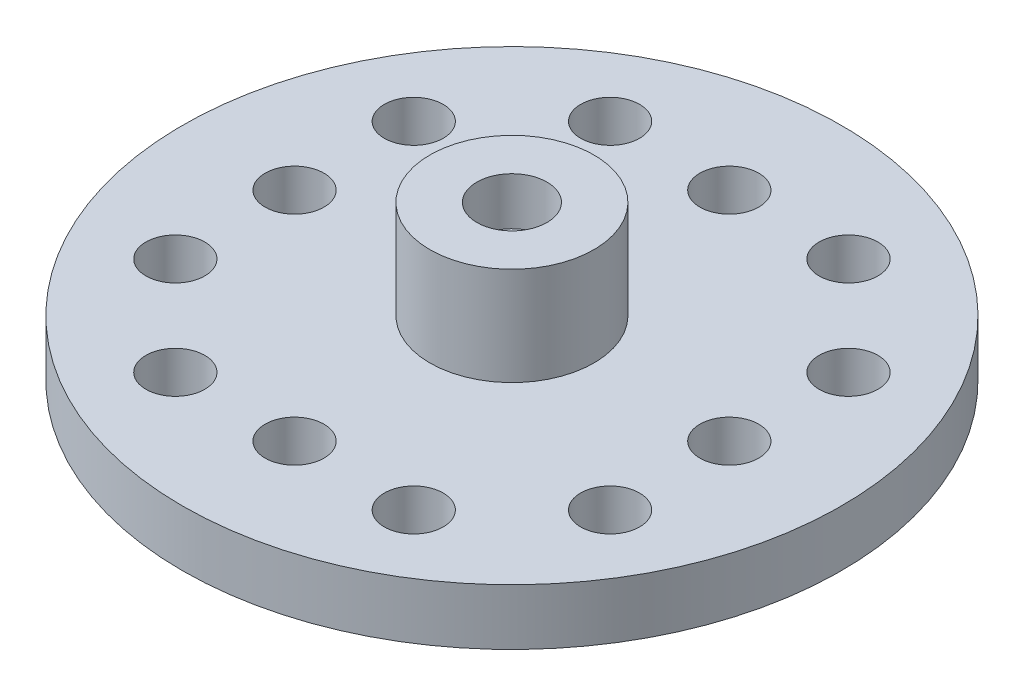
ISO-10303-21;
HEADER;
FILE_DESCRIPTION(('STEP AP214'),'2;1');
FILE_NAME('part.step','',(''),(''),'','','');
FILE_SCHEMA(('AUTOMOTIVE_DESIGN { 1 0 10303 214 1 1 1 1 }'));
ENDSEC;
DATA;
#1=APPLICATION_CONTEXT('core data for automotive mechanical design processes');
#2=APPLICATION_PROTOCOL_DEFINITION('international standard','automotive_design',2000,#1);
#3=PRODUCT_CONTEXT('',#1,'mechanical');
#4=PRODUCT('Part','Part','',(#3));
#5=PRODUCT_RELATED_PRODUCT_CATEGORY('part','',(#4));
#6=PRODUCT_DEFINITION_FORMATION('','',#4);
#7=PRODUCT_DEFINITION_CONTEXT('part definition',#1,'design');
#8=PRODUCT_DEFINITION('design','',#6,#7);
#9=PRODUCT_DEFINITION_SHAPE('','',#8);
#10=(LENGTH_UNIT() NAMED_UNIT(*) SI_UNIT(.MILLI.,.METRE.));
#11=(NAMED_UNIT(*) PLANE_ANGLE_UNIT() SI_UNIT($,.RADIAN.));
#12=(NAMED_UNIT(*) SI_UNIT($,.STERADIAN.) SOLID_ANGLE_UNIT());
#13=UNCERTAINTY_MEASURE_WITH_UNIT(LENGTH_MEASURE(1.E-05),#10,'distance_accuracy_value','');
#14=(GEOMETRIC_REPRESENTATION_CONTEXT(3) GLOBAL_UNCERTAINTY_ASSIGNED_CONTEXT((#13)) GLOBAL_UNIT_ASSIGNED_CONTEXT((#10,
#11,#12)) REPRESENTATION_CONTEXT('',''));
#15=CARTESIAN_POINT('',(0.,0.,0.));
#16=DIRECTION('',(0.,0.,1.));
#17=DIRECTION('',(1.,0.,0.));
#18=AXIS2_PLACEMENT_3D('',#15,#16,#17);
#19=CARTESIAN_POINT('',(0.,4.,0.));
#20=DIRECTION('',(0.,-1.,0.));
#21=DIRECTION('',(0.,0.,-1.));
#22=AXIS2_PLACEMENT_3D('',#19,#20,#21);
#23=CYLINDRICAL_SURFACE('',#22,23.5);
#24=CARTESIAN_POINT('',(0.,4.,0.));
#25=DIRECTION('',(0.,1.,0.));
#26=DIRECTION('',(0.,0.,1.));
#27=AXIS2_PLACEMENT_3D('',#24,#25,#26);
#28=CIRCLE('',#27,23.5);
#29=CARTESIAN_POINT('',(0.,4.,23.5));
#30=VERTEX_POINT('',#29);
#31=EDGE_CURVE('E40',#30,#30,#28,.T.);
#32=ORIENTED_EDGE('',*,*,#31,.F.);
#33=EDGE_LOOP('',(#32));
#34=FACE_BOUND('',#33,.T.);
#35=CARTESIAN_POINT('',(0.,0.,0.));
#36=DIRECTION('',(0.,1.,0.));
#37=DIRECTION('',(0.,0.,1.));
#38=AXIS2_PLACEMENT_3D('',#35,#36,#37);
#39=CIRCLE('',#38,23.5);
#40=CARTESIAN_POINT('',(0.,0.,23.5));
#41=VERTEX_POINT('',#40);
#42=EDGE_CURVE('E36',#41,#41,#39,.T.);
#43=ORIENTED_EDGE('',*,*,#42,.T.);
#44=EDGE_LOOP('',(#43));
#45=FACE_BOUND('',#44,.T.);
#46=ADVANCED_FACE('F33',(#34,#45),#23,.T.);
#47=CARTESIAN_POINT('',(0.,4.,0.));
#48=DIRECTION('',(0.,1.,0.));
#49=DIRECTION('',(0.,0.,1.));
#50=AXIS2_PLACEMENT_3D('',#47,#48,#49);
#51=PLANE('',#50);
#52=CARTESIAN_POINT('',(15.5,4.,-8.5));
#53=DIRECTION('',(0.,1.,0.));
#54=DIRECTION('',(0.,0.,-1.));
#55=AXIS2_PLACEMENT_3D('',#52,#53,#54);
#56=CIRCLE('',#55,2.1);
#57=CARTESIAN_POINT('',(15.5,4.,-10.6));
#58=VERTEX_POINT('',#57);
#59=EDGE_CURVE('E87',#58,#58,#56,.T.);
#60=ORIENTED_EDGE('',*,*,#59,.F.);
#61=EDGE_LOOP('',(#60));
#62=FACE_BOUND('',#61,.T.);
#63=CARTESIAN_POINT('',(-1.62353882256206E-13,4.,-15.5));
#64=DIRECTION('',(0.,1.,0.));
#65=DIRECTION('',(-1.,0.,0.));
#66=AXIS2_PLACEMENT_3D('',#63,#64,#65);
#67=CIRCLE('',#66,2.1);
#68=CARTESIAN_POINT('',(-2.10000000000016,4.,-15.5));
#69=VERTEX_POINT('',#68);
#70=EDGE_CURVE('E80',#69,#69,#67,.T.);
#71=ORIENTED_EDGE('',*,*,#70,.F.);
#72=EDGE_LOOP('',(#71));
#73=FACE_BOUND('',#72,.T.);
#74=CARTESIAN_POINT('',(8.49999999999984,4.,-15.5000000000001));
#75=DIRECTION('',(0.,1.,0.));
#76=DIRECTION('',(-1.,0.,0.));
#77=AXIS2_PLACEMENT_3D('',#74,#75,#76);
#78=CIRCLE('',#77,2.1);
#79=CARTESIAN_POINT('',(6.39999999999984,4.,-15.5000000000001));
#80=VERTEX_POINT('',#79);
#81=EDGE_CURVE('E101',#80,#80,#78,.T.);
#82=ORIENTED_EDGE('',*,*,#81,.F.);
#83=EDGE_LOOP('',(#82));
#84=FACE_BOUND('',#83,.T.);
#85=CARTESIAN_POINT('',(-8.50000000000016,4.,-15.4999999999999));
#86=DIRECTION('',(0.,1.,0.));
#87=DIRECTION('',(-1.,0.,0.));
#88=AXIS2_PLACEMENT_3D('',#85,#86,#87);
#89=CIRCLE('',#88,2.1);
#90=CARTESIAN_POINT('',(-10.6000000000002,4.,-15.4999999999999));
#91=VERTEX_POINT('',#90);
#92=EDGE_CURVE('E94',#91,#91,#89,.T.);
#93=ORIENTED_EDGE('',*,*,#92,.F.);
#94=EDGE_LOOP('',(#93));
#95=FACE_BOUND('',#94,.T.);
#96=CARTESIAN_POINT('',(15.5,4.,8.5));
#97=DIRECTION('',(0.,1.,0.));
#98=DIRECTION('',(0.,0.,-1.));
#99=AXIS2_PLACEMENT_3D('',#96,#97,#98);
#100=CIRCLE('',#99,2.1);
#101=CARTESIAN_POINT('',(15.5,4.,6.4));
#102=VERTEX_POINT('',#101);
#103=EDGE_CURVE('E93',#102,#102,#100,.T.);
#104=ORIENTED_EDGE('',*,*,#103,.F.);
#105=EDGE_LOOP('',(#104));
#106=FACE_BOUND('',#105,.T.);
#107=CARTESIAN_POINT('',(15.5,4.,0.));
#108=DIRECTION('',(0.,1.,0.));
#109=DIRECTION('',(0.,0.,-1.));
#110=AXIS2_PLACEMENT_3D('',#107,#108,#109);
#111=CIRCLE('',#110,2.1);
#112=CARTESIAN_POINT('',(15.5,4.,-2.1));
#113=VERTEX_POINT('',#112);
#114=EDGE_CURVE('E111',#113,#113,#111,.T.);
#115=ORIENTED_EDGE('',*,*,#114,.F.);
#116=EDGE_LOOP('',(#115));
#117=FACE_BOUND('',#116,.T.);
#118=CARTESIAN_POINT('',(8.50000000000006,4.,15.5));
#119=DIRECTION('',(0.,1.,0.));
#120=DIRECTION('',(1.,0.,0.));
#121=AXIS2_PLACEMENT_3D('',#118,#119,#120);
#122=CIRCLE('',#121,2.1);
#123=CARTESIAN_POINT('',(10.6000000000001,4.,15.5));
#124=VERTEX_POINT('',#123);
#125=EDGE_CURVE('E117',#124,#124,#122,.T.);
#126=ORIENTED_EDGE('',*,*,#125,.F.);
#127=EDGE_LOOP('',(#126));
#128=FACE_BOUND('',#127,.T.);
#129=CARTESIAN_POINT('',(-8.49999999999995,4.,15.5));
#130=DIRECTION('',(0.,1.,0.));
#131=DIRECTION('',(1.,0.,0.));
#132=AXIS2_PLACEMENT_3D('',#129,#130,#131);
#133=CIRCLE('',#132,2.1);
#134=CARTESIAN_POINT('',(-6.39999999999995,4.,15.5));
#135=VERTEX_POINT('',#134);
#136=EDGE_CURVE('E123',#135,#135,#133,.T.);
#137=ORIENTED_EDGE('',*,*,#136,.F.);
#138=EDGE_LOOP('',(#137));
#139=FACE_BOUND('',#138,.T.);
#140=CARTESIAN_POINT('',(0.,4.,15.5));
#141=DIRECTION('',(0.,1.,0.));
#142=DIRECTION('',(1.,0.,0.));
#143=AXIS2_PLACEMENT_3D('',#140,#141,#142);
#144=CIRCLE('',#143,2.1);
#145=CARTESIAN_POINT('',(2.10000000000006,4.,15.5));
#146=VERTEX_POINT('',#145);
#147=EDGE_CURVE('E74',#146,#146,#144,.T.);
#148=ORIENTED_EDGE('',*,*,#147,.F.);
#149=EDGE_LOOP('',(#148));
#150=FACE_BOUND('',#149,.T.);
#151=CARTESIAN_POINT('',(-15.5,4.,8.5));
#152=DIRECTION('',(0.,1.,0.));
#153=DIRECTION('',(0.,0.,1.));
#154=AXIS2_PLACEMENT_3D('',#151,#152,#153);
#155=CIRCLE('',#154,2.1);
#156=CARTESIAN_POINT('',(-15.5,4.,10.6));
#157=VERTEX_POINT('',#156);
#158=EDGE_CURVE('E62',#157,#157,#155,.T.);
#159=ORIENTED_EDGE('',*,*,#158,.F.);
#160=EDGE_LOOP('',(#159));
#161=FACE_BOUND('',#160,.T.);
#162=CARTESIAN_POINT('',(-15.5,4.,-8.5));
#163=DIRECTION('',(0.,1.,0.));
#164=DIRECTION('',(0.,0.,1.));
#165=AXIS2_PLACEMENT_3D('',#162,#163,#164);
#166=CIRCLE('',#165,2.1);
#167=CARTESIAN_POINT('',(-15.5,4.,-6.4));
#168=VERTEX_POINT('',#167);
#169=EDGE_CURVE('E69',#168,#168,#166,.T.);
#170=ORIENTED_EDGE('',*,*,#169,.F.);
#171=EDGE_LOOP('',(#170));
#172=FACE_BOUND('',#171,.T.);
#173=CARTESIAN_POINT('',(-15.5,4.,0.));
#174=DIRECTION('',(0.,1.,0.));
#175=DIRECTION('',(0.,0.,1.));
#176=AXIS2_PLACEMENT_3D('',#173,#174,#175);
#177=CIRCLE('',#176,2.1);
#178=CARTESIAN_POINT('',(-15.5,4.,2.1));
#179=VERTEX_POINT('',#178);
#180=EDGE_CURVE('E56',#179,#179,#177,.T.);
#181=ORIENTED_EDGE('',*,*,#180,.F.);
#182=EDGE_LOOP('',(#181));
#183=FACE_BOUND('',#182,.T.);
#184=CARTESIAN_POINT('',(0.,4.,0.));
#185=DIRECTION('',(0.,1.,0.));
#186=DIRECTION('',(0.,0.,1.));
#187=AXIS2_PLACEMENT_3D('',#184,#185,#186);
#188=CIRCLE('',#187,5.85);
#189=CARTESIAN_POINT('',(0.,4.,5.85));
#190=VERTEX_POINT('',#189);
#191=EDGE_CURVE('E10',#190,#190,#188,.T.);
#192=ORIENTED_EDGE('',*,*,#191,.F.);
#193=EDGE_LOOP('',(#192));
#194=FACE_BOUND('',#193,.T.);
#195=ORIENTED_EDGE('',*,*,#31,.T.);
#196=EDGE_LOOP('',(#195));
#197=FACE_BOUND('',#196,.T.);
#198=ADVANCED_FACE('F169',(#62,#73,#84,#95,#106,#117,#128,#139,#150,#161,#172,#183,#194,#197),
#51,.T.);
#199=CARTESIAN_POINT('',(0.,0.,0.));
#200=DIRECTION('',(0.,1.,0.));
#201=DIRECTION('',(0.,0.,1.));
#202=AXIS2_PLACEMENT_3D('',#199,#200,#201);
#203=PLANE('',#202);
#204=CARTESIAN_POINT('',(0.,0.,0.));
#205=DIRECTION('',(0.,1.,0.));
#206=DIRECTION('',(0.,0.,1.));
#207=AXIS2_PLACEMENT_3D('',#204,#205,#206);
#208=CIRCLE('',#207,2.);
#209=CARTESIAN_POINT('',(0.,0.,2.));
#210=VERTEX_POINT('',#209);
#211=EDGE_CURVE('E98',#210,#210,#208,.T.);
#212=ORIENTED_EDGE('',*,*,#211,.T.);
#213=EDGE_LOOP('',(#212));
#214=FACE_BOUND('',#213,.T.);
#215=CARTESIAN_POINT('',(15.5,0.,-8.5));
#216=DIRECTION('',(0.,1.,0.));
#217=DIRECTION('',(0.,0.,-1.));
#218=AXIS2_PLACEMENT_3D('',#215,#216,#217);
#219=CIRCLE('',#218,2.1);
#220=CARTESIAN_POINT('',(15.5,0.,-10.6));
#221=VERTEX_POINT('',#220);
#222=EDGE_CURVE('E90',#221,#221,#219,.T.);
#223=ORIENTED_EDGE('',*,*,#222,.T.);
#224=EDGE_LOOP('',(#223));
#225=FACE_BOUND('',#224,.T.);
#226=CARTESIAN_POINT('',(-1.62353882256206E-13,0.,-15.5));
#227=DIRECTION('',(0.,1.,0.));
#228=DIRECTION('',(-1.,0.,0.));
#229=AXIS2_PLACEMENT_3D('',#226,#227,#228);
#230=CIRCLE('',#229,2.1);
#231=CARTESIAN_POINT('',(-2.10000000000016,0.,-15.5));
#232=VERTEX_POINT('',#231);
#233=EDGE_CURVE('E83',#232,#232,#230,.T.);
#234=ORIENTED_EDGE('',*,*,#233,.T.);
#235=EDGE_LOOP('',(#234));
#236=FACE_BOUND('',#235,.T.);
#237=CARTESIAN_POINT('',(8.49999999999984,0.,-15.5000000000001));
#238=DIRECTION('',(0.,1.,0.));
#239=DIRECTION('',(-1.,0.,0.));
#240=AXIS2_PLACEMENT_3D('',#237,#238,#239);
#241=CIRCLE('',#240,2.1);
#242=CARTESIAN_POINT('',(6.39999999999984,0.,-15.5000000000001));
#243=VERTEX_POINT('',#242);
#244=EDGE_CURVE('E84',#243,#243,#241,.T.);
#245=ORIENTED_EDGE('',*,*,#244,.T.);
#246=EDGE_LOOP('',(#245));
#247=FACE_BOUND('',#246,.T.);
#248=CARTESIAN_POINT('',(-8.50000000000016,0.,-15.4999999999999));
#249=DIRECTION('',(0.,1.,0.));
#250=DIRECTION('',(-1.,0.,0.));
#251=AXIS2_PLACEMENT_3D('',#248,#249,#250);
#252=CIRCLE('',#251,2.1);
#253=CARTESIAN_POINT('',(-10.6000000000002,0.,-15.4999999999999));
#254=VERTEX_POINT('',#253);
#255=EDGE_CURVE('E97',#254,#254,#252,.T.);
#256=ORIENTED_EDGE('',*,*,#255,.T.);
#257=EDGE_LOOP('',(#256));
#258=FACE_BOUND('',#257,.T.);
#259=CARTESIAN_POINT('',(15.5,0.,8.5));
#260=DIRECTION('',(0.,1.,0.));
#261=DIRECTION('',(0.,0.,-1.));
#262=AXIS2_PLACEMENT_3D('',#259,#260,#261);
#263=CIRCLE('',#262,2.1);
#264=CARTESIAN_POINT('',(15.5,0.,6.4));
#265=VERTEX_POINT('',#264);
#266=EDGE_CURVE('E108',#265,#265,#263,.T.);
#267=ORIENTED_EDGE('',*,*,#266,.T.);
#268=EDGE_LOOP('',(#267));
#269=FACE_BOUND('',#268,.T.);
#270=CARTESIAN_POINT('',(15.5,0.,0.));
#271=DIRECTION('',(0.,1.,0.));
#272=DIRECTION('',(0.,0.,-1.));
#273=AXIS2_PLACEMENT_3D('',#270,#271,#272);
#274=CIRCLE('',#273,2.1);
#275=CARTESIAN_POINT('',(15.5,0.,-2.1));
#276=VERTEX_POINT('',#275);
#277=EDGE_CURVE('E114',#276,#276,#274,.T.);
#278=ORIENTED_EDGE('',*,*,#277,.T.);
#279=EDGE_LOOP('',(#278));
#280=FACE_BOUND('',#279,.T.);
#281=CARTESIAN_POINT('',(8.50000000000006,0.,15.5));
#282=DIRECTION('',(0.,1.,0.));
#283=DIRECTION('',(1.,0.,0.));
#284=AXIS2_PLACEMENT_3D('',#281,#282,#283);
#285=CIRCLE('',#284,2.1);
#286=CARTESIAN_POINT('',(10.6000000000001,0.,15.5));
#287=VERTEX_POINT('',#286);
#288=EDGE_CURVE('E120',#287,#287,#285,.T.);
#289=ORIENTED_EDGE('',*,*,#288,.T.);
#290=EDGE_LOOP('',(#289));
#291=FACE_BOUND('',#290,.T.);
#292=CARTESIAN_POINT('',(-8.49999999999995,0.,15.5));
#293=DIRECTION('',(0.,1.,0.));
#294=DIRECTION('',(1.,0.,0.));
#295=AXIS2_PLACEMENT_3D('',#292,#293,#294);
#296=CIRCLE('',#295,2.1);
#297=CARTESIAN_POINT('',(-6.39999999999995,0.,15.5));
#298=VERTEX_POINT('',#297);
#299=EDGE_CURVE('E77',#298,#298,#296,.T.);
#300=ORIENTED_EDGE('',*,*,#299,.T.);
#301=EDGE_LOOP('',(#300));
#302=FACE_BOUND('',#301,.T.);
#303=CARTESIAN_POINT('',(0.,0.,15.5));
#304=DIRECTION('',(0.,1.,0.));
#305=DIRECTION('',(1.,0.,0.));
#306=AXIS2_PLACEMENT_3D('',#303,#304,#305);
#307=CIRCLE('',#306,2.1);
#308=CARTESIAN_POINT('',(2.10000000000006,0.,15.5));
#309=VERTEX_POINT('',#308);
#310=EDGE_CURVE('E66',#309,#309,#307,.T.);
#311=ORIENTED_EDGE('',*,*,#310,.T.);
#312=EDGE_LOOP('',(#311));
#313=FACE_BOUND('',#312,.T.);
#314=CARTESIAN_POINT('',(-15.5,0.,8.5));
#315=DIRECTION('',(0.,1.,0.));
#316=DIRECTION('',(0.,0.,1.));
#317=AXIS2_PLACEMENT_3D('',#314,#315,#316);
#318=CIRCLE('',#317,2.1);
#319=CARTESIAN_POINT('',(-15.5,0.,10.6));
#320=VERTEX_POINT('',#319);
#321=EDGE_CURVE('E65',#320,#320,#318,.T.);
#322=ORIENTED_EDGE('',*,*,#321,.T.);
#323=EDGE_LOOP('',(#322));
#324=FACE_BOUND('',#323,.T.);
#325=CARTESIAN_POINT('',(-15.5,0.,-8.5));
#326=DIRECTION('',(0.,1.,0.));
#327=DIRECTION('',(0.,0.,1.));
#328=AXIS2_PLACEMENT_3D('',#325,#326,#327);
#329=CIRCLE('',#328,2.1);
#330=CARTESIAN_POINT('',(-15.5,0.,-6.4));
#331=VERTEX_POINT('',#330);
#332=EDGE_CURVE('E59',#331,#331,#329,.T.);
#333=ORIENTED_EDGE('',*,*,#332,.T.);
#334=EDGE_LOOP('',(#333));
#335=FACE_BOUND('',#334,.T.);
#336=CARTESIAN_POINT('',(-15.5,0.,0.));
#337=DIRECTION('',(0.,1.,0.));
#338=DIRECTION('',(0.,0.,1.));
#339=AXIS2_PLACEMENT_3D('',#336,#337,#338);
#340=CIRCLE('',#339,2.1);
#341=CARTESIAN_POINT('',(-15.5,0.,2.1));
#342=VERTEX_POINT('',#341);
#343=EDGE_CURVE('E53',#342,#342,#340,.T.);
#344=ORIENTED_EDGE('',*,*,#343,.T.);
#345=EDGE_LOOP('',(#344));
#346=FACE_BOUND('',#345,.T.);
#347=ORIENTED_EDGE('',*,*,#42,.F.);
#348=EDGE_LOOP('',(#347));
#349=FACE_BOUND('',#348,.T.);
#350=ADVANCED_FACE('F134',(#214,#225,#236,#247,#258,#269,#280,#291,#302,#313,#324,#335,#346,
#349),#203,.F.);
#351=CARTESIAN_POINT('',(0.,11.,0.));
#352=DIRECTION('',(0.,-1.,0.));
#353=DIRECTION('',(0.,0.,-1.));
#354=AXIS2_PLACEMENT_3D('',#351,#352,#353);
#355=CYLINDRICAL_SURFACE('',#354,5.85);
#356=CARTESIAN_POINT('',(0.,11.,0.));
#357=DIRECTION('',(0.,1.,0.));
#358=DIRECTION('',(0.,0.,1.));
#359=AXIS2_PLACEMENT_3D('',#356,#357,#358);
#360=CIRCLE('',#359,5.85);
#361=CARTESIAN_POINT('',(0.,11.,5.85));
#362=VERTEX_POINT('',#361);
#363=EDGE_CURVE('E46',#362,#362,#360,.T.);
#364=ORIENTED_EDGE('',*,*,#363,.F.);
#365=EDGE_LOOP('',(#364));
#366=FACE_BOUND('',#365,.T.);
#367=ORIENTED_EDGE('',*,*,#191,.T.);
#368=EDGE_LOOP('',(#367));
#369=FACE_BOUND('',#368,.T.);
#370=ADVANCED_FACE('F160',(#366,#369),#355,.T.);
#371=CARTESIAN_POINT('',(0.,11.,0.));
#372=DIRECTION('',(0.,1.,0.));
#373=DIRECTION('',(0.,0.,1.));
#374=AXIS2_PLACEMENT_3D('',#371,#372,#373);
#375=PLANE('',#374);
#376=CARTESIAN_POINT('',(0.,11.,0.));
#377=DIRECTION('',(0.,1.,0.));
#378=DIRECTION('',(0.,0.,1.));
#379=AXIS2_PLACEMENT_3D('',#376,#377,#378);
#380=CIRCLE('',#379,2.5);
#381=CARTESIAN_POINT('',(0.,11.,2.5));
#382=VERTEX_POINT('',#381);
#383=EDGE_CURVE('E50',#382,#382,#380,.T.);
#384=ORIENTED_EDGE('',*,*,#383,.F.);
#385=EDGE_LOOP('',(#384));
#386=FACE_BOUND('',#385,.T.);
#387=ORIENTED_EDGE('',*,*,#363,.T.);
#388=EDGE_LOOP('',(#387));
#389=FACE_BOUND('',#388,.T.);
#390=ADVANCED_FACE('F154',(#386,#389),#375,.T.);
#391=CARTESIAN_POINT('',(0.,7.6,0.));
#392=DIRECTION('',(0.,1.,0.));
#393=DIRECTION('',(0.,0.,1.));
#394=AXIS2_PLACEMENT_3D('',#391,#392,#393);
#395=CYLINDRICAL_SURFACE('',#394,2.5);
#396=CARTESIAN_POINT('',(0.,7.6,0.));
#397=DIRECTION('',(0.,1.,0.));
#398=DIRECTION('',(0.,0.,1.));
#399=AXIS2_PLACEMENT_3D('',#396,#397,#398);
#400=CIRCLE('',#399,2.5);
#401=CARTESIAN_POINT('',(0.,7.6,2.5));
#402=VERTEX_POINT('',#401);
#403=EDGE_CURVE('E49',#402,#402,#400,.T.);
#404=ORIENTED_EDGE('',*,*,#403,.F.);
#405=EDGE_LOOP('',(#404));
#406=FACE_BOUND('',#405,.T.);
#407=ORIENTED_EDGE('',*,*,#383,.T.);
#408=EDGE_LOOP('',(#407));
#409=FACE_BOUND('',#408,.T.);
#410=ADVANCED_FACE('F148',(#406,#409),#395,.F.);
#411=CARTESIAN_POINT('',(0.,7.6,0.));
#412=DIRECTION('',(0.,1.,0.));
#413=DIRECTION('',(0.,0.,1.));
#414=AXIS2_PLACEMENT_3D('',#411,#412,#413);
#415=PLANE('',#414);
#416=CARTESIAN_POINT('',(0.,7.6,0.));
#417=DIRECTION('',(0.,1.,0.));
#418=DIRECTION('',(0.,0.,1.));
#419=AXIS2_PLACEMENT_3D('',#416,#417,#418);
#420=CIRCLE('',#419,2.);
#421=CARTESIAN_POINT('',(0.,7.6,2.));
#422=VERTEX_POINT('',#421);
#423=EDGE_CURVE('E128',#422,#422,#420,.T.);
#424=ORIENTED_EDGE('',*,*,#423,.F.);
#425=EDGE_LOOP('',(#424));
#426=FACE_BOUND('',#425,.T.);
#427=ORIENTED_EDGE('',*,*,#403,.T.);
#428=EDGE_LOOP('',(#427));
#429=FACE_BOUND('',#428,.T.);
#430=ADVANCED_FACE('F144',(#426,#429),#415,.T.);
#431=CARTESIAN_POINT('',(-15.5,0.,0.));
#432=DIRECTION('',(0.,1.,0.));
#433=DIRECTION('',(0.,0.,1.));
#434=AXIS2_PLACEMENT_3D('',#431,#432,#433);
#435=CYLINDRICAL_SURFACE('',#434,2.1);
#436=ORIENTED_EDGE('',*,*,#343,.F.);
#437=EDGE_LOOP('',(#436));
#438=FACE_BOUND('',#437,.T.);
#439=ORIENTED_EDGE('',*,*,#180,.T.);
#440=EDGE_LOOP('',(#439));
#441=FACE_BOUND('',#440,.T.);
#442=ADVANCED_FACE('F147',(#438,#441),#435,.F.);
#443=CARTESIAN_POINT('',(-15.5,0.,-8.5));
#444=DIRECTION('',(0.,1.,0.));
#445=DIRECTION('',(0.,0.,1.));
#446=AXIS2_PLACEMENT_3D('',#443,#444,#445);
#447=CYLINDRICAL_SURFACE('',#446,2.1);
#448=ORIENTED_EDGE('',*,*,#332,.F.);
#449=EDGE_LOOP('',(#448));
#450=FACE_BOUND('',#449,.T.);
#451=ORIENTED_EDGE('',*,*,#169,.T.);
#452=EDGE_LOOP('',(#451));
#453=FACE_BOUND('',#452,.T.);
#454=ADVANCED_FACE('F211',(#450,#453),#447,.F.);
#455=CARTESIAN_POINT('',(-15.5,0.,8.5));
#456=DIRECTION('',(0.,1.,0.));
#457=DIRECTION('',(0.,0.,1.));
#458=AXIS2_PLACEMENT_3D('',#455,#456,#457);
#459=CYLINDRICAL_SURFACE('',#458,2.1);
#460=ORIENTED_EDGE('',*,*,#321,.F.);
#461=EDGE_LOOP('',(#460));
#462=FACE_BOUND('',#461,.T.);
#463=ORIENTED_EDGE('',*,*,#158,.T.);
#464=EDGE_LOOP('',(#463));
#465=FACE_BOUND('',#464,.T.);
#466=ADVANCED_FACE('F217',(#462,#465),#459,.F.);
#467=CARTESIAN_POINT('',(0.,0.,15.5));
#468=DIRECTION('',(0.,1.,0.));
#469=DIRECTION('',(0.,0.,1.));
#470=AXIS2_PLACEMENT_3D('',#467,#468,#469);
#471=CYLINDRICAL_SURFACE('',#470,2.1);
#472=ORIENTED_EDGE('',*,*,#310,.F.);
#473=EDGE_LOOP('',(#472));
#474=FACE_BOUND('',#473,.T.);
#475=ORIENTED_EDGE('',*,*,#147,.T.);
#476=EDGE_LOOP('',(#475));
#477=FACE_BOUND('',#476,.T.);
#478=ADVANCED_FACE('F223',(#474,#477),#471,.F.);
#479=CARTESIAN_POINT('',(-8.49999999999995,0.,15.5));
#480=DIRECTION('',(0.,1.,0.));
#481=DIRECTION('',(0.,0.,1.));
#482=AXIS2_PLACEMENT_3D('',#479,#480,#481);
#483=CYLINDRICAL_SURFACE('',#482,2.1);
#484=ORIENTED_EDGE('',*,*,#299,.F.);
#485=EDGE_LOOP('',(#484));
#486=FACE_BOUND('',#485,.T.);
#487=ORIENTED_EDGE('',*,*,#136,.T.);
#488=EDGE_LOOP('',(#487));
#489=FACE_BOUND('',#488,.T.);
#490=ADVANCED_FACE('F228',(#486,#489),#483,.F.);
#491=CARTESIAN_POINT('',(8.50000000000006,0.,15.5));
#492=DIRECTION('',(0.,1.,0.));
#493=DIRECTION('',(0.,0.,1.));
#494=AXIS2_PLACEMENT_3D('',#491,#492,#493);
#495=CYLINDRICAL_SURFACE('',#494,2.1);
#496=ORIENTED_EDGE('',*,*,#288,.F.);
#497=EDGE_LOOP('',(#496));
#498=FACE_BOUND('',#497,.T.);
#499=ORIENTED_EDGE('',*,*,#125,.T.);
#500=EDGE_LOOP('',(#499));
#501=FACE_BOUND('',#500,.T.);
#502=ADVANCED_FACE('F252',(#498,#501),#495,.F.);
#503=CARTESIAN_POINT('',(15.5,0.,0.));
#504=DIRECTION('',(0.,1.,0.));
#505=DIRECTION('',(0.,0.,1.));
#506=AXIS2_PLACEMENT_3D('',#503,#504,#505);
#507=CYLINDRICAL_SURFACE('',#506,2.1);
#508=ORIENTED_EDGE('',*,*,#277,.F.);
#509=EDGE_LOOP('',(#508));
#510=FACE_BOUND('',#509,.T.);
#511=ORIENTED_EDGE('',*,*,#114,.T.);
#512=EDGE_LOOP('',(#511));
#513=FACE_BOUND('',#512,.T.);
#514=ADVANCED_FACE('F248',(#510,#513),#507,.F.);
#515=CARTESIAN_POINT('',(15.5,0.,8.5));
#516=DIRECTION('',(0.,1.,0.));
#517=DIRECTION('',(0.,0.,1.));
#518=AXIS2_PLACEMENT_3D('',#515,#516,#517);
#519=CYLINDRICAL_SURFACE('',#518,2.1);
#520=ORIENTED_EDGE('',*,*,#266,.F.);
#521=EDGE_LOOP('',(#520));
#522=FACE_BOUND('',#521,.T.);
#523=ORIENTED_EDGE('',*,*,#103,.T.);
#524=EDGE_LOOP('',(#523));
#525=FACE_BOUND('',#524,.T.);
#526=ADVANCED_FACE('F241',(#522,#525),#519,.F.);
#527=CARTESIAN_POINT('',(-8.50000000000016,0.,-15.4999999999999));
#528=DIRECTION('',(0.,1.,0.));
#529=DIRECTION('',(0.,0.,1.));
#530=AXIS2_PLACEMENT_3D('',#527,#528,#529);
#531=CYLINDRICAL_SURFACE('',#530,2.1);
#532=ORIENTED_EDGE('',*,*,#255,.F.);
#533=EDGE_LOOP('',(#532));
#534=FACE_BOUND('',#533,.T.);
#535=ORIENTED_EDGE('',*,*,#92,.T.);
#536=EDGE_LOOP('',(#535));
#537=FACE_BOUND('',#536,.T.);
#538=ADVANCED_FACE('F238',(#534,#537),#531,.F.);
#539=CARTESIAN_POINT('',(8.49999999999984,0.,-15.5000000000001));
#540=DIRECTION('',(0.,1.,0.));
#541=DIRECTION('',(0.,0.,1.));
#542=AXIS2_PLACEMENT_3D('',#539,#540,#541);
#543=CYLINDRICAL_SURFACE('',#542,2.1);
#544=ORIENTED_EDGE('',*,*,#244,.F.);
#545=EDGE_LOOP('',(#544));
#546=FACE_BOUND('',#545,.T.);
#547=ORIENTED_EDGE('',*,*,#81,.T.);
#548=EDGE_LOOP('',(#547));
#549=FACE_BOUND('',#548,.T.);
#550=ADVANCED_FACE('F233',(#546,#549),#543,.F.);
#551=CARTESIAN_POINT('',(-1.62353882256206E-13,0.,-15.5));
#552=DIRECTION('',(0.,1.,0.));
#553=DIRECTION('',(0.,0.,1.));
#554=AXIS2_PLACEMENT_3D('',#551,#552,#553);
#555=CYLINDRICAL_SURFACE('',#554,2.1);
#556=ORIENTED_EDGE('',*,*,#233,.F.);
#557=EDGE_LOOP('',(#556));
#558=FACE_BOUND('',#557,.T.);
#559=ORIENTED_EDGE('',*,*,#70,.T.);
#560=EDGE_LOOP('',(#559));
#561=FACE_BOUND('',#560,.T.);
#562=ADVANCED_FACE('F230',(#558,#561),#555,.F.);
#563=CARTESIAN_POINT('',(15.5,0.,-8.5));
#564=DIRECTION('',(0.,1.,0.));
#565=DIRECTION('',(0.,0.,1.));
#566=AXIS2_PLACEMENT_3D('',#563,#564,#565);
#567=CYLINDRICAL_SURFACE('',#566,2.1);
#568=ORIENTED_EDGE('',*,*,#222,.F.);
#569=EDGE_LOOP('',(#568));
#570=FACE_BOUND('',#569,.T.);
#571=ORIENTED_EDGE('',*,*,#59,.T.);
#572=EDGE_LOOP('',(#571));
#573=FACE_BOUND('',#572,.T.);
#574=ADVANCED_FACE('F140',(#570,#573),#567,.F.);
#575=CARTESIAN_POINT('',(0.,0.,0.));
#576=DIRECTION('',(0.,1.,0.));
#577=DIRECTION('',(0.,0.,1.));
#578=AXIS2_PLACEMENT_3D('',#575,#576,#577);
#579=CYLINDRICAL_SURFACE('',#578,2.);
#580=ORIENTED_EDGE('',*,*,#211,.F.);
#581=EDGE_LOOP('',(#580));
#582=FACE_BOUND('',#581,.T.);
#583=ORIENTED_EDGE('',*,*,#423,.T.);
#584=EDGE_LOOP('',(#583));
#585=FACE_BOUND('',#584,.T.);
#586=ADVANCED_FACE('F137',(#582,#585),#579,.F.);
#587=CLOSED_SHELL('',(#46,#198,#350,#370,#390,#410,#430,#442,#454,#466,#478,#490,#502,#514,#526,
#538,#550,#562,#574,#586));
#588=MANIFOLD_SOLID_BREP('B2',#587);
#589=ADVANCED_BREP_SHAPE_REPRESENTATION('',(#18,#588),#14);
#590=SHAPE_DEFINITION_REPRESENTATION(#9,#589);
ENDSEC;
END-ISO-10303-21;
